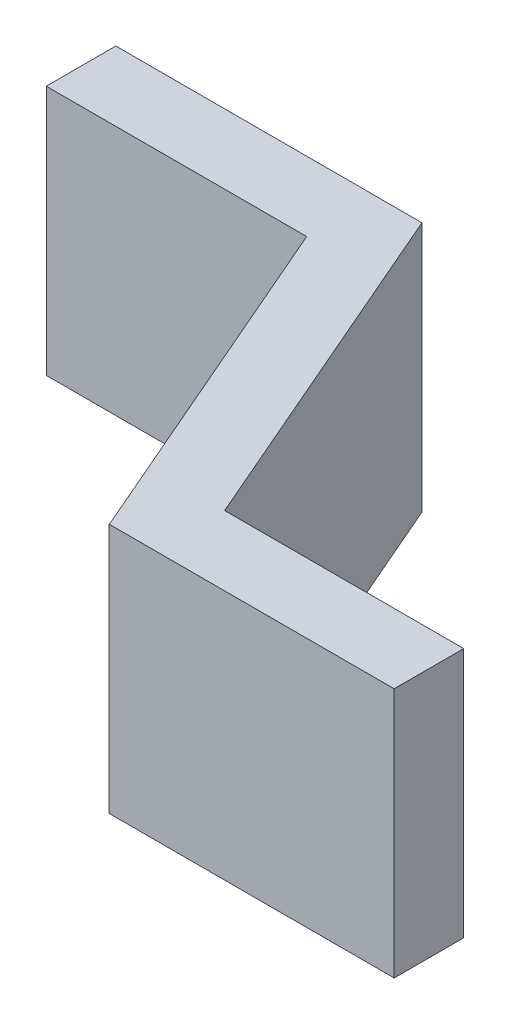
ISO-10303-21;
HEADER;
FILE_DESCRIPTION(('STEP AP214'),'2;1');
FILE_NAME('part.step','',(''),(''),'','','');
FILE_SCHEMA(('AUTOMOTIVE_DESIGN { 1 0 10303 214 1 1 1 1 }'));
ENDSEC;
DATA;
#1=APPLICATION_CONTEXT('core data for automotive mechanical design processes');
#2=APPLICATION_PROTOCOL_DEFINITION('international standard','automotive_design',2000,#1);
#3=PRODUCT_CONTEXT('',#1,'mechanical');
#4=PRODUCT('Part','Part','',(#3));
#5=PRODUCT_RELATED_PRODUCT_CATEGORY('part','',(#4));
#6=PRODUCT_DEFINITION_FORMATION('','',#4);
#7=PRODUCT_DEFINITION_CONTEXT('part definition',#1,'design');
#8=PRODUCT_DEFINITION('design','',#6,#7);
#9=PRODUCT_DEFINITION_SHAPE('','',#8);
#10=(LENGTH_UNIT() NAMED_UNIT(*) SI_UNIT(.MILLI.,.METRE.));
#11=(NAMED_UNIT(*) PLANE_ANGLE_UNIT() SI_UNIT($,.RADIAN.));
#12=(NAMED_UNIT(*) SI_UNIT($,.STERADIAN.) SOLID_ANGLE_UNIT());
#13=UNCERTAINTY_MEASURE_WITH_UNIT(LENGTH_MEASURE(1.E-05),#10,'distance_accuracy_value','');
#14=(GEOMETRIC_REPRESENTATION_CONTEXT(3) GLOBAL_UNCERTAINTY_ASSIGNED_CONTEXT((#13)) GLOBAL_UNIT_ASSIGNED_CONTEXT((#10,
#11,#12)) REPRESENTATION_CONTEXT('',''));
#15=CARTESIAN_POINT('',(0.,0.,0.));
#16=DIRECTION('',(0.,0.,1.));
#17=DIRECTION('',(1.,0.,0.));
#18=AXIS2_PLACEMENT_3D('',#15,#16,#17);
#19=CARTESIAN_POINT('',(0.,6.62,0.));
#20=DIRECTION('',(1.,0.,0.));
#21=DIRECTION('',(0.,0.,-1.));
#22=AXIS2_PLACEMENT_3D('',#19,#20,#21);
#23=PLANE('',#22);
#24=DIRECTION('',(0.,1.,0.));
#25=VECTOR('',#24,1.);
#26=CARTESIAN_POINT('',(0.,6.62,0.));
#27=LINE('',#26,#25);
#28=CARTESIAN_POINT('',(0.,6.980000014305,-1.30339419427667E-10));
#29=VERTEX_POINT('',#28);
#30=CARTESIAN_POINT('',(0.,6.62,-1.556831963824E-10));
#31=VERTEX_POINT('',#30);
#32=EDGE_CURVE('E123',#29,#31,#27,.F.);
#33=ORIENTED_EDGE('',*,*,#32,.T.);
#34=DIRECTION('',(0.,0.,1.));
#35=VECTOR('',#34,1.);
#36=CARTESIAN_POINT('',(0.,6.62,0.));
#37=LINE('',#36,#35);
#38=CARTESIAN_POINT('',(0.,6.62,0.10000000149));
#39=VERTEX_POINT('',#38);
#40=EDGE_CURVE('E115',#31,#39,#37,.T.);
#41=ORIENTED_EDGE('',*,*,#40,.T.);
#42=DIRECTION('',(0.,1.,0.));
#43=VECTOR('',#42,1.);
#44=CARTESIAN_POINT('',(0.,6.62,0.10000000149));
#45=LINE('',#44,#43);
#46=CARTESIAN_POINT('',(0.,6.980000014305,0.10000000149));
#47=VERTEX_POINT('',#46);
#48=EDGE_CURVE('E134',#47,#39,#45,.F.);
#49=ORIENTED_EDGE('',*,*,#48,.F.);
#50=DIRECTION('',(0.,0.,1.));
#51=VECTOR('',#50,1.);
#52=CARTESIAN_POINT('',(0.,6.980000014305,0.));
#53=LINE('',#52,#51);
#54=EDGE_CURVE('E140',#29,#47,#53,.T.);
#55=ORIENTED_EDGE('',*,*,#54,.F.);
#56=EDGE_LOOP('',(#33,#41,#49,#55));
#57=FACE_BOUND('',#56,.T.);
#58=ADVANCED_FACE('F17',(#57),#23,.F.);
#59=CARTESIAN_POINT('',(0.,6.62,0.10000000149));
#60=DIRECTION('',(0.,0.,1.));
#61=DIRECTION('',(1.,0.,0.));
#62=AXIS2_PLACEMENT_3D('',#59,#60,#61);
#63=PLANE('',#62);
#64=DIRECTION('',(0.,1.,0.));
#65=VECTOR('',#64,1.);
#66=CARTESIAN_POINT('',(0.374312226605181,6.62,0.100000001489922));
#67=LINE('',#66,#65);
#68=CARTESIAN_POINT('',(0.37431222660506,6.980000014305,0.100000001489974));
#69=VERTEX_POINT('',#68);
#70=CARTESIAN_POINT('',(0.374312226605091,6.62,0.100000001489974));
#71=VERTEX_POINT('',#70);
#72=EDGE_CURVE('E132',#69,#71,#67,.F.);
#73=ORIENTED_EDGE('',*,*,#72,.F.);
#74=DIRECTION('',(1.,0.,0.));
#75=VECTOR('',#74,1.);
#76=CARTESIAN_POINT('',(0.44,6.980000014305,0.10000000149));
#77=LINE('',#76,#75);
#78=EDGE_CURVE('E137',#47,#69,#77,.T.);
#79=ORIENTED_EDGE('',*,*,#78,.F.);
#80=ORIENTED_EDGE('',*,*,#48,.T.);
#81=DIRECTION('',(1.,0.,0.));
#82=VECTOR('',#81,1.);
#83=CARTESIAN_POINT('',(0.44,6.62,0.10000000149));
#84=LINE('',#83,#82);
#85=EDGE_CURVE('E111',#39,#71,#84,.T.);
#86=ORIENTED_EDGE('',*,*,#85,.T.);
#87=EDGE_LOOP('',(#73,#79,#80,#86));
#88=FACE_BOUND('',#87,.T.);
#89=ADVANCED_FACE('F214',(#88),#63,.T.);
#90=CARTESIAN_POINT('',(0.348224508223,6.62,0.03971472531736));
#91=DIRECTION('',(-0.917754904098641,0.,0.397147247255844));
#92=DIRECTION('',(0.397147247255844,0.,0.917754904098641));
#93=AXIS2_PLACEMENT_3D('',#90,#91,#92);
#94=PLANE('',#93);
#95=DIRECTION('',(0.397147247255413,0.,0.917754904098827));
#96=VECTOR('',#95,1.);
#97=CARTESIAN_POINT('',(0.374312226605,6.62,0.10000000149));
#98=LINE('',#97,#96);
#99=CARTESIAN_POINT('',(0.59,6.62,0.59842599627));
#100=VERTEX_POINT('',#99);
#101=EDGE_CURVE('E110',#71,#100,#98,.T.);
#102=ORIENTED_EDGE('',*,*,#101,.T.);
#103=DIRECTION('',(0.,1.,0.));
#104=VECTOR('',#103,1.);
#105=CARTESIAN_POINT('',(0.59,6.62,0.59842599627));
#106=LINE('',#105,#104);
#107=CARTESIAN_POINT('',(0.59,6.980000014305,0.59842599627));
#108=VERTEX_POINT('',#107);
#109=EDGE_CURVE('E86',#100,#108,#106,.T.);
#110=ORIENTED_EDGE('',*,*,#109,.T.);
#111=DIRECTION('',(0.397147247255413,0.,0.917754904098827));
#112=VECTOR('',#111,1.);
#113=CARTESIAN_POINT('',(0.374312226605,6.980000014305,0.10000000149));
#114=LINE('',#113,#112);
#115=EDGE_CURVE('E139',#69,#108,#114,.T.);
#116=ORIENTED_EDGE('',*,*,#115,.F.);
#117=ORIENTED_EDGE('',*,*,#72,.T.);
#118=EDGE_LOOP('',(#102,#110,#116,#117));
#119=FACE_BOUND('',#118,.T.);
#120=ADVANCED_FACE('F215',(#119),#94,.T.);
#121=CARTESIAN_POINT('',(0.59,6.62,0.5));
#122=DIRECTION('',(1.,0.,0.));
#123=DIRECTION('',(0.,0.,-1.));
#124=AXIS2_PLACEMENT_3D('',#121,#122,#123);
#125=PLANE('',#124);
#126=ORIENTED_EDGE('',*,*,#109,.F.);
#127=DIRECTION('',(0.,0.,-1.));
#128=VECTOR('',#127,1.);
#129=CARTESIAN_POINT('',(0.59,6.62,0.5));
#130=LINE('',#129,#128);
#131=CARTESIAN_POINT('',(0.59,6.62,0.60000000149));
#132=VERTEX_POINT('',#131);
#133=EDGE_CURVE('E20',#100,#132,#130,.F.);
#134=ORIENTED_EDGE('',*,*,#133,.T.);
#135=DIRECTION('',(0.,1.,0.));
#136=VECTOR('',#135,1.);
#137=CARTESIAN_POINT('',(0.59,6.62,0.60000000149));
#138=LINE('',#137,#136);
#139=CARTESIAN_POINT('',(0.59,6.980000014305,0.60000000149));
#140=VERTEX_POINT('',#139);
#141=EDGE_CURVE('E93',#140,#132,#138,.F.);
#142=ORIENTED_EDGE('',*,*,#141,.F.);
#143=DIRECTION('',(0.,0.,1.));
#144=VECTOR('',#143,1.);
#145=CARTESIAN_POINT('',(0.59,6.980000014305,0.));
#146=LINE('',#145,#144);
#147=EDGE_CURVE('E182',#108,#140,#146,.T.);
#148=ORIENTED_EDGE('',*,*,#147,.F.);
#149=EDGE_LOOP('',(#126,#134,#142,#148));
#150=FACE_BOUND('',#149,.T.);
#151=ADVANCED_FACE('F109',(#150),#125,.F.);
#152=CARTESIAN_POINT('',(0.59,6.62,0.60000000149));
#153=DIRECTION('',(0.,0.,1.));
#154=DIRECTION('',(1.,0.,0.));
#155=AXIS2_PLACEMENT_3D('',#152,#153,#154);
#156=PLANE('',#155);
#157=ORIENTED_EDGE('',*,*,#141,.T.);
#158=DIRECTION('',(1.,0.,0.));
#159=VECTOR('',#158,1.);
#160=CARTESIAN_POINT('',(0.44,6.62,0.60000000149));
#161=LINE('',#160,#159);
#162=CARTESIAN_POINT('',(0.999999996424,6.62,0.60000000149));
#163=VERTEX_POINT('',#162);
#164=EDGE_CURVE('E97',#132,#163,#161,.T.);
#165=ORIENTED_EDGE('',*,*,#164,.T.);
#166=DIRECTION('',(0.,1.,0.));
#167=VECTOR('',#166,1.);
#168=CARTESIAN_POINT('',(0.999999996424,6.62,0.60000000149));
#169=LINE('',#168,#167);
#170=CARTESIAN_POINT('',(0.999999996424,6.980000014305,0.60000000149));
#171=VERTEX_POINT('',#170);
#172=EDGE_CURVE('E99',#171,#163,#169,.F.);
#173=ORIENTED_EDGE('',*,*,#172,.F.);
#174=DIRECTION('',(1.,0.,0.));
#175=VECTOR('',#174,1.);
#176=CARTESIAN_POINT('',(0.44,6.980000014305,0.60000000149));
#177=LINE('',#176,#175);
#178=EDGE_CURVE('E98',#140,#171,#177,.T.);
#179=ORIENTED_EDGE('',*,*,#178,.F.);
#180=EDGE_LOOP('',(#157,#165,#173,#179));
#181=FACE_BOUND('',#180,.T.);
#182=ADVANCED_FACE('F95',(#181),#156,.T.);
#183=CARTESIAN_POINT('',(0.999999996424,6.62,0.5));
#184=DIRECTION('',(1.,0.,0.));
#185=DIRECTION('',(0.,0.,-1.));
#186=AXIS2_PLACEMENT_3D('',#183,#184,#185);
#187=PLANE('',#186);
#188=DIRECTION('',(0.,0.,1.));
#189=VECTOR('',#188,1.);
#190=CARTESIAN_POINT('',(0.999999996424,6.62,0.));
#191=LINE('',#190,#189);
#192=CARTESIAN_POINT('',(0.999999996424,6.62,0.5));
#193=VERTEX_POINT('',#192);
#194=EDGE_CURVE('E107',#163,#193,#191,.F.);
#195=ORIENTED_EDGE('',*,*,#194,.T.);
#196=DIRECTION('',(0.,1.,0.));
#197=VECTOR('',#196,1.);
#198=CARTESIAN_POINT('',(0.999999996424,6.62,0.5));
#199=LINE('',#198,#197);
#200=CARTESIAN_POINT('',(0.999999996424,6.980000014305,0.5));
#201=VERTEX_POINT('',#200);
#202=EDGE_CURVE('E192',#193,#201,#199,.T.);
#203=ORIENTED_EDGE('',*,*,#202,.T.);
#204=DIRECTION('',(0.,0.,1.));
#205=VECTOR('',#204,1.);
#206=CARTESIAN_POINT('',(0.999999996424,6.980000014305,0.));
#207=LINE('',#206,#205);
#208=EDGE_CURVE('E126',#171,#201,#207,.F.);
#209=ORIENTED_EDGE('',*,*,#208,.F.);
#210=ORIENTED_EDGE('',*,*,#172,.T.);
#211=EDGE_LOOP('',(#195,#203,#209,#210));
#212=FACE_BOUND('',#211,.T.);
#213=ADVANCED_FACE('F238',(#212),#187,.T.);
#214=CARTESIAN_POINT('',(0.,6.62,0.));
#215=DIRECTION('',(0.,0.,1.));
#216=DIRECTION('',(1.,0.,0.));
#217=AXIS2_PLACEMENT_3D('',#214,#215,#216);
#218=PLANE('',#217);
#219=DIRECTION('',(1.,0.,0.));
#220=VECTOR('',#219,1.);
#221=CARTESIAN_POINT('',(0.44,6.62,-2.335247945736E-10));
#222=LINE('',#221,#220);
#223=CARTESIAN_POINT('',(0.439999999656335,6.62,-3.43069646239979E-10));
#224=VERTEX_POINT('',#223);
#225=EDGE_CURVE('E155',#224,#31,#222,.F.);
#226=ORIENTED_EDGE('',*,*,#225,.T.);
#227=ORIENTED_EDGE('',*,*,#32,.F.);
#228=DIRECTION('',(1.,0.,0.));
#229=VECTOR('',#228,1.);
#230=CARTESIAN_POINT('',(0.44,6.980000014305,-1.955091291415E-10));
#231=LINE('',#230,#229);
#232=CARTESIAN_POINT('',(0.439999999458534,6.980000014305,-1.955091291415E-10));
#233=VERTEX_POINT('',#232);
#234=EDGE_CURVE('E147',#233,#29,#231,.F.);
#235=ORIENTED_EDGE('',*,*,#234,.F.);
#236=DIRECTION('',(0.,1.,0.));
#237=VECTOR('',#236,1.);
#238=CARTESIAN_POINT('',(0.439999999804137,6.62,-4.52614497906357E-10));
#239=LINE('',#238,#237);
#240=EDGE_CURVE('E128',#233,#224,#239,.F.);
#241=ORIENTED_EDGE('',*,*,#240,.T.);
#242=EDGE_LOOP('',(#226,#227,#235,#241));
#243=FACE_BOUND('',#242,.T.);
#244=ADVANCED_FACE('F235',(#243),#218,.F.);
#245=CARTESIAN_POINT('',(0.44,6.62,0.));
#246=DIRECTION('',(0.,1.,0.));
#247=DIRECTION('',(0.,0.,1.));
#248=AXIS2_PLACEMENT_3D('',#245,#246,#247);
#249=PLANE('',#248);
#250=DIRECTION('',(1.,0.,0.));
#251=VECTOR('',#250,1.);
#252=CARTESIAN_POINT('',(0.59,6.62,0.5));
#253=LINE('',#252,#251);
#254=CARTESIAN_POINT('',(0.656368904967001,6.62,0.499999999999999));
#255=VERTEX_POINT('',#254);
#256=EDGE_CURVE('E166',#255,#193,#253,.T.);
#257=ORIENTED_EDGE('',*,*,#256,.T.);
#258=ORIENTED_EDGE('',*,*,#194,.F.);
#259=ORIENTED_EDGE('',*,*,#164,.F.);
#260=ORIENTED_EDGE('',*,*,#133,.F.);
#261=ORIENTED_EDGE('',*,*,#101,.F.);
#262=ORIENTED_EDGE('',*,*,#85,.F.);
#263=ORIENTED_EDGE('',*,*,#40,.F.);
#264=ORIENTED_EDGE('',*,*,#225,.F.);
#265=DIRECTION('',(0.397147247255844,0.,0.917754904098641));
#266=VECTOR('',#265,1.);
#267=CARTESIAN_POINT('',(0.44,6.62,0.));
#268=LINE('',#267,#266);
#269=EDGE_CURVE('E160',#224,#255,#268,.T.);
#270=ORIENTED_EDGE('',*,*,#269,.T.);
#271=EDGE_LOOP('',(#257,#258,#259,#260,#261,#262,#263,#264,#270));
#272=FACE_BOUND('',#271,.T.);
#273=ADVANCED_FACE('F104',(#272),#249,.F.);
#274=CARTESIAN_POINT('',(0.59,6.62,0.5));
#275=DIRECTION('',(0.,0.,1.));
#276=DIRECTION('',(1.,0.,0.));
#277=AXIS2_PLACEMENT_3D('',#274,#275,#276);
#278=PLANE('',#277);
#279=ORIENTED_EDGE('',*,*,#256,.F.);
#280=DIRECTION('',(0.,1.,0.));
#281=VECTOR('',#280,1.);
#282=CARTESIAN_POINT('',(0.656368904967005,6.62,0.499999999999998));
#283=LINE('',#282,#281);
#284=CARTESIAN_POINT('',(0.656368904967001,6.980000014305,0.499999999999999));
#285=VERTEX_POINT('',#284);
#286=EDGE_CURVE('E26',#255,#285,#283,.T.);
#287=ORIENTED_EDGE('',*,*,#286,.T.);
#288=DIRECTION('',(1.,0.,0.));
#289=VECTOR('',#288,1.);
#290=CARTESIAN_POINT('',(0.44,6.980000014305,0.5));
#291=LINE('',#290,#289);
#292=EDGE_CURVE('E34',#201,#285,#291,.F.);
#293=ORIENTED_EDGE('',*,*,#292,.F.);
#294=ORIENTED_EDGE('',*,*,#202,.F.);
#295=EDGE_LOOP('',(#279,#287,#293,#294));
#296=FACE_BOUND('',#295,.T.);
#297=ADVANCED_FACE('F199',(#296),#278,.F.);
#298=CARTESIAN_POINT('',(0.44,6.980000014305,0.));
#299=DIRECTION('',(0.,1.,0.));
#300=DIRECTION('',(0.,0.,1.));
#301=AXIS2_PLACEMENT_3D('',#298,#299,#300);
#302=PLANE('',#301);
#303=ORIENTED_EDGE('',*,*,#178,.T.);
#304=ORIENTED_EDGE('',*,*,#208,.T.);
#305=ORIENTED_EDGE('',*,*,#292,.T.);
#306=DIRECTION('',(0.397147247255844,0.,0.917754904098641));
#307=VECTOR('',#306,1.);
#308=CARTESIAN_POINT('',(0.44,6.980000014305,0.));
#309=LINE('',#308,#307);
#310=EDGE_CURVE('E11',#285,#233,#309,.F.);
#311=ORIENTED_EDGE('',*,*,#310,.T.);
#312=ORIENTED_EDGE('',*,*,#234,.T.);
#313=ORIENTED_EDGE('',*,*,#54,.T.);
#314=ORIENTED_EDGE('',*,*,#78,.T.);
#315=ORIENTED_EDGE('',*,*,#115,.T.);
#316=ORIENTED_EDGE('',*,*,#147,.T.);
#317=EDGE_LOOP('',(#303,#304,#305,#311,#312,#313,#314,#315,#316));
#318=FACE_BOUND('',#317,.T.);
#319=ADVANCED_FACE('F204',(#318),#302,.T.);
#320=CARTESIAN_POINT('',(0.44,6.62,0.));
#321=DIRECTION('',(-0.917754904098641,0.,0.397147247255844));
#322=DIRECTION('',(0.397147247255844,0.,0.917754904098641));
#323=AXIS2_PLACEMENT_3D('',#320,#321,#322);
#324=PLANE('',#323);
#325=ORIENTED_EDGE('',*,*,#286,.F.);
#326=ORIENTED_EDGE('',*,*,#269,.F.);
#327=ORIENTED_EDGE('',*,*,#240,.F.);
#328=ORIENTED_EDGE('',*,*,#310,.F.);
#329=EDGE_LOOP('',(#325,#326,#327,#328));
#330=FACE_BOUND('',#329,.T.);
#331=ADVANCED_FACE('F201',(#330),#324,.F.);
#332=CLOSED_SHELL('',(#58,#89,#120,#151,#182,#213,#244,#273,#297,#319,#331));
#333=MANIFOLD_SOLID_BREP('B1',#332);
#334=ADVANCED_BREP_SHAPE_REPRESENTATION('',(#18,#333),#14);
#335=SHAPE_DEFINITION_REPRESENTATION(#9,#334);
ENDSEC;
END-ISO-10303-21;
